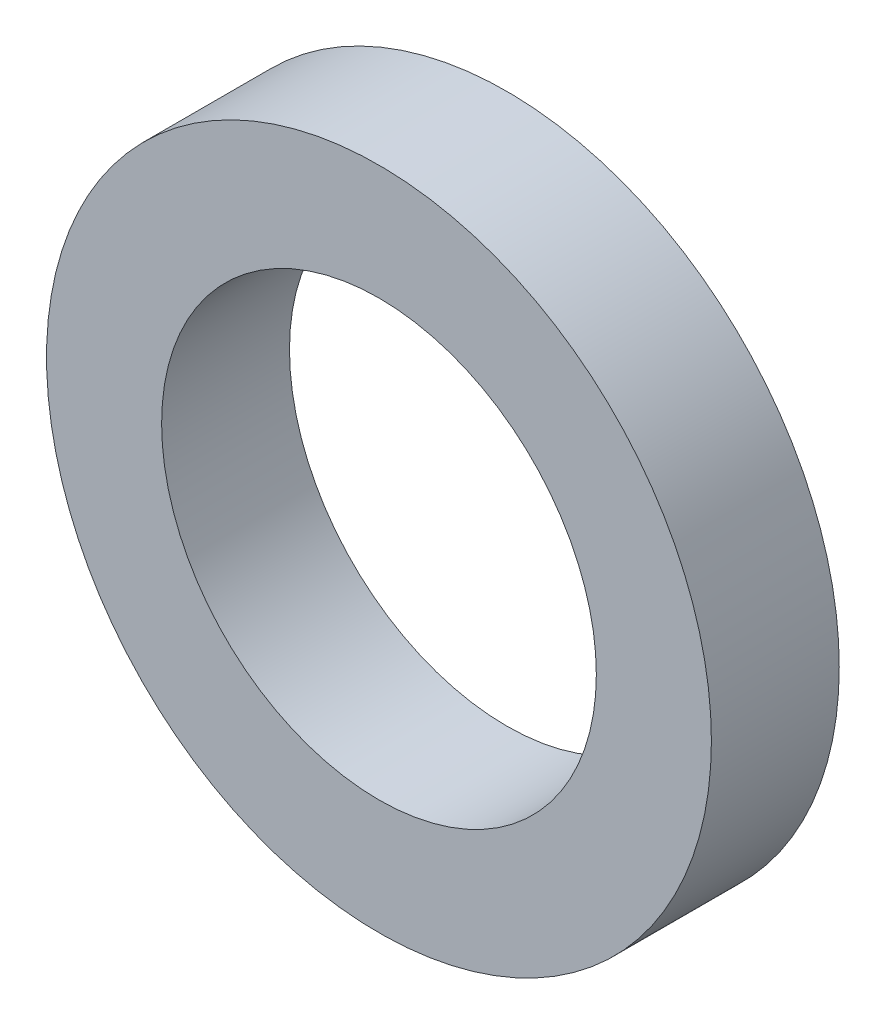
ISO-10303-21;
HEADER;
FILE_DESCRIPTION(('STEP AP214'),'2;1');
FILE_NAME('part.step','',(''),(''),'','','');
FILE_SCHEMA(('AUTOMOTIVE_DESIGN { 1 0 10303 214 1 1 1 1 }'));
ENDSEC;
DATA;
#1=APPLICATION_CONTEXT('core data for automotive mechanical design processes');
#2=APPLICATION_PROTOCOL_DEFINITION('international standard','automotive_design',2000,#1);
#3=PRODUCT_CONTEXT('',#1,'mechanical');
#4=PRODUCT('Part','Part','',(#3));
#5=PRODUCT_RELATED_PRODUCT_CATEGORY('part','',(#4));
#6=PRODUCT_DEFINITION_FORMATION('','',#4);
#7=PRODUCT_DEFINITION_CONTEXT('part definition',#1,'design');
#8=PRODUCT_DEFINITION('design','',#6,#7);
#9=PRODUCT_DEFINITION_SHAPE('','',#8);
#10=(LENGTH_UNIT() NAMED_UNIT(*) SI_UNIT(.MILLI.,.METRE.));
#11=(NAMED_UNIT(*) PLANE_ANGLE_UNIT() SI_UNIT($,.RADIAN.));
#12=(NAMED_UNIT(*) SI_UNIT($,.STERADIAN.) SOLID_ANGLE_UNIT());
#13=UNCERTAINTY_MEASURE_WITH_UNIT(LENGTH_MEASURE(1.E-05),#10,'distance_accuracy_value','');
#14=(GEOMETRIC_REPRESENTATION_CONTEXT(3) GLOBAL_UNCERTAINTY_ASSIGNED_CONTEXT((#13)) GLOBAL_UNIT_ASSIGNED_CONTEXT((#10,
#11,#12)) REPRESENTATION_CONTEXT('',''));
#15=CARTESIAN_POINT('',(0.,0.,0.));
#16=DIRECTION('',(0.,0.,1.));
#17=DIRECTION('',(1.,0.,0.));
#18=AXIS2_PLACEMENT_3D('',#15,#16,#17);
#19=CARTESIAN_POINT('',(0.,0.,5.));
#20=DIRECTION('',(0.,0.,1.));
#21=DIRECTION('',(1.,0.,0.));
#22=AXIS2_PLACEMENT_3D('',#19,#20,#21);
#23=PLANE('',#22);
#24=CARTESIAN_POINT('',(0.,0.,5.));
#25=DIRECTION('',(0.,0.,1.));
#26=DIRECTION('',(1.,0.,0.));
#27=AXIS2_PLACEMENT_3D('',#24,#25,#26);
#28=CIRCLE('',#27,13.);
#29=CARTESIAN_POINT('',(13.,0.,5.));
#30=VERTEX_POINT('',#29);
#31=EDGE_CURVE('E10',#30,#30,#28,.T.);
#32=ORIENTED_EDGE('',*,*,#31,.T.);
#33=EDGE_LOOP('',(#32));
#34=FACE_BOUND('',#33,.T.);
#35=CARTESIAN_POINT('',(0.,0.,5.));
#36=DIRECTION('',(0.,0.,1.));
#37=DIRECTION('',(1.,0.,0.));
#38=AXIS2_PLACEMENT_3D('',#35,#36,#37);
#39=CIRCLE('',#38,8.5);
#40=CARTESIAN_POINT('',(8.5,0.,5.));
#41=VERTEX_POINT('',#40);
#42=EDGE_CURVE('E52',#41,#41,#39,.T.);
#43=ORIENTED_EDGE('',*,*,#42,.F.);
#44=EDGE_LOOP('',(#43));
#45=FACE_BOUND('',#44,.T.);
#46=ADVANCED_FACE('F41',(#34,#45),#23,.T.);
#47=CARTESIAN_POINT('',(0.,0.,0.));
#48=DIRECTION('',(0.,0.,1.));
#49=DIRECTION('',(1.,0.,0.));
#50=AXIS2_PLACEMENT_3D('',#47,#48,#49);
#51=PLANE('',#50);
#52=CARTESIAN_POINT('',(0.,0.,0.));
#53=DIRECTION('',(0.,0.,1.));
#54=DIRECTION('',(1.,0.,0.));
#55=AXIS2_PLACEMENT_3D('',#52,#53,#54);
#56=CIRCLE('',#55,13.);
#57=CARTESIAN_POINT('',(13.,0.,0.));
#58=VERTEX_POINT('',#57);
#59=EDGE_CURVE('E45',#58,#58,#56,.T.);
#60=ORIENTED_EDGE('',*,*,#59,.F.);
#61=EDGE_LOOP('',(#60));
#62=FACE_BOUND('',#61,.T.);
#63=CARTESIAN_POINT('',(0.,0.,0.));
#64=DIRECTION('',(0.,0.,1.));
#65=DIRECTION('',(1.,0.,0.));
#66=AXIS2_PLACEMENT_3D('',#63,#64,#65);
#67=CIRCLE('',#66,8.5);
#68=CARTESIAN_POINT('',(8.5,0.,0.));
#69=VERTEX_POINT('',#68);
#70=EDGE_CURVE('E54',#69,#69,#67,.T.);
#71=ORIENTED_EDGE('',*,*,#70,.T.);
#72=EDGE_LOOP('',(#71));
#73=FACE_BOUND('',#72,.T.);
#74=ADVANCED_FACE('F64',(#62,#73),#51,.F.);
#75=CARTESIAN_POINT('',(0.,0.,5.));
#76=DIRECTION('',(0.,0.,-1.));
#77=DIRECTION('',(-1.,0.,0.));
#78=AXIS2_PLACEMENT_3D('',#75,#76,#77);
#79=CYLINDRICAL_SURFACE('',#78,13.);
#80=ORIENTED_EDGE('',*,*,#31,.F.);
#81=EDGE_LOOP('',(#80));
#82=FACE_BOUND('',#81,.T.);
#83=ORIENTED_EDGE('',*,*,#59,.T.);
#84=EDGE_LOOP('',(#83));
#85=FACE_BOUND('',#84,.T.);
#86=ADVANCED_FACE('F43',(#82,#85),#79,.T.);
#87=CARTESIAN_POINT('',(0.,0.,5.));
#88=DIRECTION('',(0.,0.,-1.));
#89=DIRECTION('',(-1.,0.,0.));
#90=AXIS2_PLACEMENT_3D('',#87,#88,#89);
#91=CYLINDRICAL_SURFACE('',#90,8.5);
#92=ORIENTED_EDGE('',*,*,#42,.T.);
#93=EDGE_LOOP('',(#92));
#94=FACE_BOUND('',#93,.T.);
#95=ORIENTED_EDGE('',*,*,#70,.F.);
#96=EDGE_LOOP('',(#95));
#97=FACE_BOUND('',#96,.T.);
#98=ADVANCED_FACE('F60',(#94,#97),#91,.F.);
#99=CLOSED_SHELL('',(#46,#74,#86,#98));
#100=MANIFOLD_SOLID_BREP('B2',#99);
#101=ADVANCED_BREP_SHAPE_REPRESENTATION('',(#18,#100),#14);
#102=SHAPE_DEFINITION_REPRESENTATION(#9,#101);
ENDSEC;
END-ISO-10303-21;
